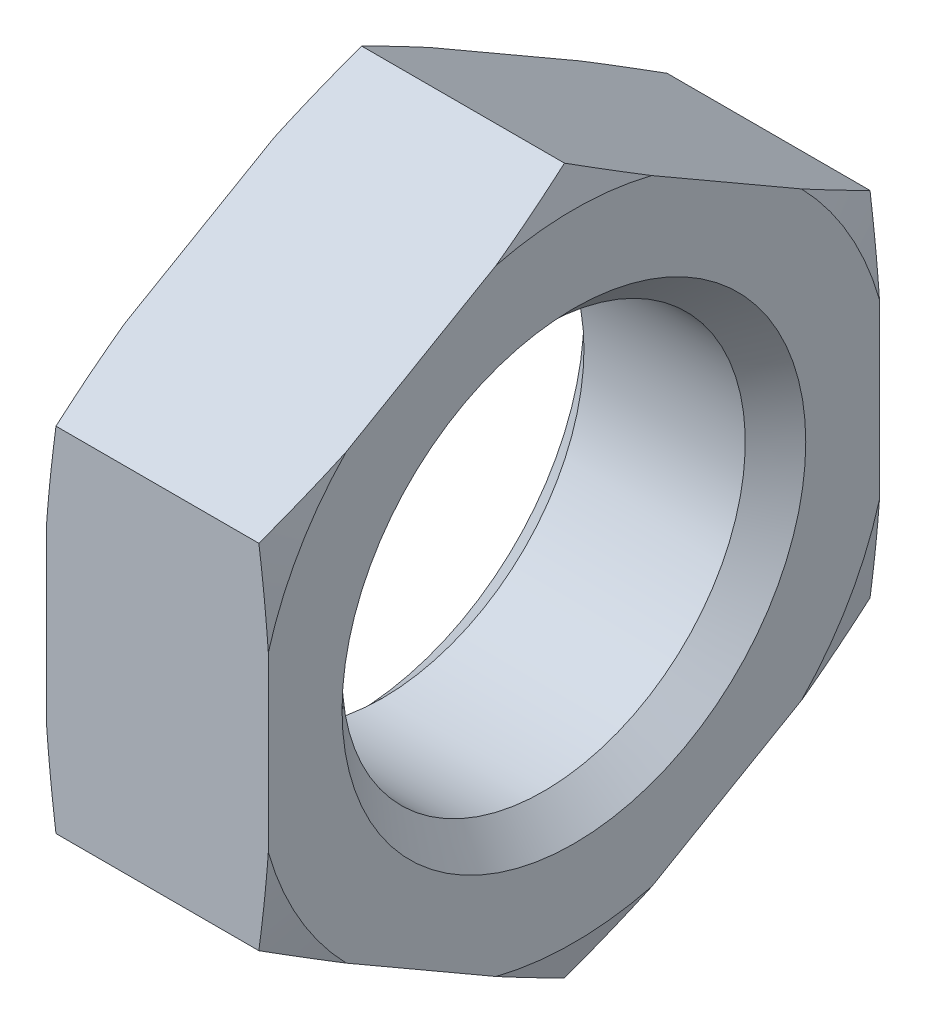
ISO-10303-21;
HEADER;
FILE_DESCRIPTION(('STEP AP214'),'2;1');
FILE_NAME('part.step','',(''),(''),'','','');
FILE_SCHEMA(('AUTOMOTIVE_DESIGN { 1 0 10303 214 1 1 1 1 }'));
ENDSEC;
DATA;
#1=APPLICATION_CONTEXT('core data for automotive mechanical design processes');
#2=APPLICATION_PROTOCOL_DEFINITION('international standard','automotive_design',2000,#1);
#3=PRODUCT_CONTEXT('',#1,'mechanical');
#4=PRODUCT('Part','Part','',(#3));
#5=PRODUCT_RELATED_PRODUCT_CATEGORY('part','',(#4));
#6=PRODUCT_DEFINITION_FORMATION('','',#4);
#7=PRODUCT_DEFINITION_CONTEXT('part definition',#1,'design');
#8=PRODUCT_DEFINITION('design','',#6,#7);
#9=PRODUCT_DEFINITION_SHAPE('','',#8);
#10=(LENGTH_UNIT() NAMED_UNIT(*) SI_UNIT(.MILLI.,.METRE.));
#11=(NAMED_UNIT(*) PLANE_ANGLE_UNIT() SI_UNIT($,.RADIAN.));
#12=(NAMED_UNIT(*) SI_UNIT($,.STERADIAN.) SOLID_ANGLE_UNIT());
#13=UNCERTAINTY_MEASURE_WITH_UNIT(LENGTH_MEASURE(1.E-05),#10,'distance_accuracy_value','');
#14=(GEOMETRIC_REPRESENTATION_CONTEXT(3) GLOBAL_UNCERTAINTY_ASSIGNED_CONTEXT((#13)) GLOBAL_UNIT_ASSIGNED_CONTEXT((#10,
#11,#12)) REPRESENTATION_CONTEXT('',''));
#15=CARTESIAN_POINT('',(0.,0.,0.));
#16=DIRECTION('',(0.,0.,1.));
#17=DIRECTION('',(1.,0.,0.));
#18=AXIS2_PLACEMENT_3D('',#15,#16,#17);
#19=CARTESIAN_POINT('',(1.1,2.,0.));
#20=DIRECTION('',(-1.,0.,0.));
#21=DIRECTION('',(0.,0.,1.));
#22=AXIS2_PLACEMENT_3D('',#19,#20,#21);
#23=PLANE('',#22);
#24=CARTESIAN_POINT('',(1.1,0.,0.));
#25=DIRECTION('',(-1.,0.,0.));
#26=DIRECTION('',(0.,0.,1.));
#27=AXIS2_PLACEMENT_3D('',#24,#25,#26);
#28=CIRCLE('',#27,2.3);
#29=CARTESIAN_POINT('',(1.1,0.,2.3));
#30=VERTEX_POINT('',#29);
#31=EDGE_CURVE('E495',#30,#30,#28,.T.);
#32=ORIENTED_EDGE('',*,*,#31,.T.);
#33=EDGE_LOOP('',(#32));
#34=FACE_BOUND('',#33,.T.);
#35=DIRECTION('',(0.,-0.500000000000001,0.866025403784438));
#36=VECTOR('',#35,1.);
#37=CARTESIAN_POINT('',(1.1,3.5,0.));
#38=LINE('',#37,#36);
#39=CARTESIAN_POINT('',(1.1,3.05366070498706,0.773082336376887));
#40=VERTEX_POINT('',#39);
#41=CARTESIAN_POINT('',(1.1,2.19633929501293,2.25800657686865));
#42=VERTEX_POINT('',#41);
#43=EDGE_CURVE('E218',#40,#42,#38,.T.);
#44=ORIENTED_EDGE('',*,*,#43,.T.);
#45=CARTESIAN_POINT('',(1.1,0.,0.));
#46=DIRECTION('',(-1.,0.,0.));
#47=DIRECTION('',(0.,0.,1.));
#48=AXIS2_PLACEMENT_3D('',#45,#46,#47);
#49=CIRCLE('',#48,3.15);
#50=CARTESIAN_POINT('',(1.1,0.857321409974109,3.03108891324554));
#51=VERTEX_POINT('',#50);
#52=EDGE_CURVE('E215',#51,#42,#49,.T.);
#53=ORIENTED_EDGE('',*,*,#52,.F.);
#54=DIRECTION('',(0.,-1.,0.));
#55=VECTOR('',#54,1.);
#56=CARTESIAN_POINT('',(1.1,1.74999999999999,3.03108891324554));
#57=LINE('',#56,#55);
#58=CARTESIAN_POINT('',(1.1,-0.857321409974132,3.03108891324553));
#59=VERTEX_POINT('',#58);
#60=EDGE_CURVE('E88',#51,#59,#57,.T.);
#61=ORIENTED_EDGE('',*,*,#60,.T.);
#62=CARTESIAN_POINT('',(1.1,-2.19633929501295,2.25800657686864));
#63=VERTEX_POINT('',#62);
#64=EDGE_CURVE('E213',#63,#59,#49,.T.);
#65=ORIENTED_EDGE('',*,*,#64,.F.);
#66=DIRECTION('',(0.,-0.499999999999995,-0.866025403784442));
#67=VECTOR('',#66,1.);
#68=CARTESIAN_POINT('',(1.1,-1.75000000000001,3.03108891324553));
#69=LINE('',#68,#67);
#70=CARTESIAN_POINT('',(1.1,-3.05366070498706,0.773082336376864));
#71=VERTEX_POINT('',#70);
#72=EDGE_CURVE('E217',#63,#71,#69,.T.);
#73=ORIENTED_EDGE('',*,*,#72,.T.);
#74=CARTESIAN_POINT('',(1.1,-3.05366070498705,-0.773082336376907));
#75=VERTEX_POINT('',#74);
#76=EDGE_CURVE('E223',#75,#71,#49,.T.);
#77=ORIENTED_EDGE('',*,*,#76,.F.);
#78=DIRECTION('',(0.,0.500000000000007,-0.866025403784435));
#79=VECTOR('',#78,1.);
#80=CARTESIAN_POINT('',(1.1,-3.5,0.));
#81=LINE('',#80,#79);
#82=CARTESIAN_POINT('',(1.1,-2.19633929501292,-2.25800657686867));
#83=VERTEX_POINT('',#82);
#84=EDGE_CURVE('E268',#75,#83,#81,.T.);
#85=ORIENTED_EDGE('',*,*,#84,.T.);
#86=CARTESIAN_POINT('',(1.1,-0.857321409974092,-3.03108891324554));
#87=VERTEX_POINT('',#86);
#88=EDGE_CURVE('E229',#87,#83,#49,.T.);
#89=ORIENTED_EDGE('',*,*,#88,.F.);
#90=DIRECTION('',(0.,1.,0.));
#91=VECTOR('',#90,1.);
#92=CARTESIAN_POINT('',(1.1,-1.74999999999997,-3.03108891324555));
#93=LINE('',#92,#91);
#94=CARTESIAN_POINT('',(1.1,0.857321409974154,-3.03108891324552));
#95=VERTEX_POINT('',#94);
#96=EDGE_CURVE('E266',#87,#95,#93,.T.);
#97=ORIENTED_EDGE('',*,*,#96,.T.);
#98=CARTESIAN_POINT('',(1.1,2.19633929501298,-2.25800657686861));
#99=VERTEX_POINT('',#98);
#100=EDGE_CURVE('E244',#99,#95,#49,.T.);
#101=ORIENTED_EDGE('',*,*,#100,.F.);
#102=DIRECTION('',(0.,0.499999999999995,0.866025403784441));
#103=VECTOR('',#102,1.);
#104=CARTESIAN_POINT('',(1.1,1.75000000000003,-3.03108891324551));
#105=LINE('',#104,#103);
#106=CARTESIAN_POINT('',(1.1,3.05366070498705,-0.773082336376908));
#107=VERTEX_POINT('',#106);
#108=EDGE_CURVE('E275',#99,#107,#105,.T.);
#109=ORIENTED_EDGE('',*,*,#108,.T.);
#110=EDGE_CURVE('E237',#40,#107,#49,.T.);
#111=ORIENTED_EDGE('',*,*,#110,.F.);
#112=EDGE_LOOP('',(#44,#53,#61,#65,#73,#77,#85,#89,#97,#101,#109,#111));
#113=FACE_BOUND('',#112,.T.);
#114=ADVANCED_FACE('F71',(#34,#113),#23,.F.);
#115=CARTESIAN_POINT('',(1.1,0.,0.));
#116=DIRECTION('',(-1.,0.,0.));
#117=DIRECTION('',(0.,0.,1.));
#118=AXIS2_PLACEMENT_3D('',#115,#116,#117);
#119=CONICAL_SURFACE('',#118,3.15,1.30899693899575);
#120=CARTESIAN_POINT('',(1.00610947351796,1.74959585481156,3.03178891324554));
#121=CARTESIAN_POINT('',(1.0256052308755,1.82230239029664,2.90585749974308));
#122=CARTESIAN_POINT('',(1.04330458977084,1.89514080805315,2.77969765944587));
#123=CARTESIAN_POINT('',(1.07440122173703,2.04107504352429,2.52693214904613));
#124=CARTESIAN_POINT('',(1.08779674493292,2.11417095375118,2.40032631870766));
#125=CARTESIAN_POINT('',(1.10950322208669,2.26017669628245,2.1474369544467));
#126=CARTESIAN_POINT('',(1.11784007850632,2.33308553991135,2.02115513296033));
#127=CARTESIAN_POINT('',(1.1290189999827,2.47899626954088,1.76843033587255));
#128=CARTESIAN_POINT('',(1.13186212966697,2.55199813477044,1.64198739624766));
#129=CARTESIAN_POINT('',(1.13186212966697,2.69800186522955,1.38910151699788));
#130=CARTESIAN_POINT('',(1.1290189999827,2.77100373045911,1.26265857737299));
#131=CARTESIAN_POINT('',(1.11784007850632,2.91691446008864,1.00993378028521));
#132=CARTESIAN_POINT('',(1.10950322208669,2.98982330371755,0.883651958798843));
#133=CARTESIAN_POINT('',(1.08779674493292,3.13582904624881,0.630762594537875));
#134=CARTESIAN_POINT('',(1.07440122173703,3.2089249564757,0.504156764199411));
#135=CARTESIAN_POINT('',(1.04330458977084,3.35485919194684,0.251391253799667));
#136=CARTESIAN_POINT('',(1.0256052308755,3.42769760970336,0.12523141350246));
#137=CARTESIAN_POINT('',(1.00610947351796,3.50040414518843,-0.000700000000000386));
#138=B_SPLINE_CURVE_WITH_KNOTS('',3,(#120,#121,#122,#123,#124,#125,#126,#127,#128,#129,#130,
#131,#132,#133,#134,#135,#136,#137),.UNSPECIFIED.,.F.,.F.,(4,2,2,2,2,2,2,2,4),(0.,
0.440165588767844,0.880509916439907,1.3185800421982,1.75656526597199,2.19455048974578,
2.63262061550407,3.07296494317613,3.51313053194398),.UNSPECIFIED.);
#139=CARTESIAN_POINT('',(1.00621778264911,3.5,0.));
#140=VERTEX_POINT('',#139);
#141=EDGE_CURVE('E346',#40,#140,#138,.T.);
#142=ORIENTED_EDGE('',*,*,#141,.F.);
#143=ORIENTED_EDGE('',*,*,#110,.T.);
#144=CARTESIAN_POINT('',(1.00610947351796,3.50040414518843,0.0007));
#145=CARTESIAN_POINT('',(1.0256052308755,3.42769760970336,-0.125231413502459));
#146=CARTESIAN_POINT('',(1.04330458977084,3.35485919194685,-0.251391253799665));
#147=CARTESIAN_POINT('',(1.07440122173703,3.20892495647571,-0.504156764199407));
#148=CARTESIAN_POINT('',(1.08779674493291,3.13582904624882,-0.63076259453787));
#149=CARTESIAN_POINT('',(1.10950322208669,2.98982330371756,-0.883651958798835));
#150=CARTESIAN_POINT('',(1.11784007850632,2.91691446008865,-1.0099337802852));
#151=CARTESIAN_POINT('',(1.1290189999827,2.77100373045913,-1.26265857737298));
#152=CARTESIAN_POINT('',(1.13186212966696,2.69800186522957,-1.38910151699787));
#153=CARTESIAN_POINT('',(1.13186212966696,2.55199813477046,-1.64198739624765));
#154=CARTESIAN_POINT('',(1.1290189999827,2.47899626954091,-1.76843033587253));
#155=CARTESIAN_POINT('',(1.11784007850632,2.33308553991138,-2.02115513296032));
#156=CARTESIAN_POINT('',(1.10950322208669,2.26017669628248,-2.14743695444668));
#157=CARTESIAN_POINT('',(1.08779674493291,2.11417095375122,-2.40032631870764));
#158=CARTESIAN_POINT('',(1.07440122173703,2.04107504352433,-2.52693214904611));
#159=CARTESIAN_POINT('',(1.04330458977084,1.89514080805319,-2.77969765944585));
#160=CARTESIAN_POINT('',(1.0256052308755,1.82230239029668,-2.90585749974305));
#161=CARTESIAN_POINT('',(1.00610947351796,1.7495958548116,-3.03178891324551));
#162=B_SPLINE_CURVE_WITH_KNOTS('',3,(#144,#145,#146,#147,#148,#149,#150,#151,#152,#153,#154,
#155,#156,#157,#158,#159,#160,#161),.UNSPECIFIED.,.F.,.F.,(4,2,2,2,2,2,2,2,4),(0.,
0.440165588767838,0.880509916439896,1.31858004219818,1.75656526597197,2.19455048974575,
2.63262061550404,3.07296494317609,3.51313053194393),.UNSPECIFIED.);
#163=EDGE_CURVE('E393',#140,#107,#162,.T.);
#164=ORIENTED_EDGE('',*,*,#163,.F.);
#165=EDGE_LOOP('',(#142,#143,#164));
#166=FACE_BOUND('',#165,.T.);
#167=ADVANCED_FACE('F354',(#166),#119,.T.);
#168=CARTESIAN_POINT('',(1.00621778264911,1.75000000000003,-3.03108891324551));
#169=VERTEX_POINT('',#168);
#170=EDGE_CURVE('E386',#99,#169,#162,.T.);
#171=ORIENTED_EDGE('',*,*,#170,.F.);
#172=ORIENTED_EDGE('',*,*,#100,.T.);
#173=CARTESIAN_POINT('',(1.00612398636583,1.75070000000004,-3.03108891324551));
#174=CARTESIAN_POINT('',(1.02561764201151,1.60529588468332,-3.03108891324552));
#175=CARTESIAN_POINT('',(1.04331502753195,1.45962803849627,-3.03108891324552));
#176=CARTESIAN_POINT('',(1.07440811334088,1.16777762856228,-3.03108891324552));
#177=CARTESIAN_POINT('',(1.08780206429238,1.02159487985723,-3.03108891324552));
#178=CARTESIAN_POINT('',(1.10950595979123,0.7296014747785,-3.03108891324552));
#179=CARTESIAN_POINT('',(1.11784180118863,0.583792795209892,-3.03108891324553));
#180=CARTESIAN_POINT('',(1.12901935399264,0.291989382743893,-3.03108891324553));
#181=CARTESIAN_POINT('',(1.13186212966697,0.145994691371962,-3.03108891324553));
#182=CARTESIAN_POINT('',(1.13186212966697,-0.145994691371899,-3.03108891324553));
#183=CARTESIAN_POINT('',(1.12901935399264,-0.29198938274383,-3.03108891324554));
#184=CARTESIAN_POINT('',(1.11784180118863,-0.583792795209829,-3.03108891324554));
#185=CARTESIAN_POINT('',(1.10950595979123,-0.729601474778437,-3.03108891324554));
#186=CARTESIAN_POINT('',(1.08780206429238,-1.02159487985716,-3.03108891324554));
#187=CARTESIAN_POINT('',(1.07440811334088,-1.16777762856222,-3.03108891324554));
#188=CARTESIAN_POINT('',(1.04331502753195,-1.45962803849621,-3.03108891324555));
#189=CARTESIAN_POINT('',(1.02561764201151,-1.60529588468325,-3.03108891324555));
#190=CARTESIAN_POINT('',(1.00612398636583,-1.75069999999997,-3.03108891324555));
#191=B_SPLINE_CURVE_WITH_KNOTS('',3,(#173,#174,#175,#176,#177,#178,#179,#180,#181,#182,#183,
#184,#185,#186,#187,#188,#189,#190),.UNSPECIFIED.,.F.,.F.,(4,2,2,2,2,2,2,2,4),(0.,
0.440138115142682,0.880454919794815,1.31849790923074,1.75645602042235,2.19441413161397,
2.63245712104989,3.07277392570203,3.51291204084471),.UNSPECIFIED.);
#192=EDGE_CURVE('E468',#169,#95,#191,.T.);
#193=ORIENTED_EDGE('',*,*,#192,.F.);
#194=EDGE_LOOP('',(#171,#172,#193));
#195=FACE_BOUND('',#194,.T.);
#196=ADVANCED_FACE('F358',(#195),#119,.T.);
#197=CARTESIAN_POINT('',(1.00621778264911,-1.74999999999997,-3.03108891324555));
#198=VERTEX_POINT('',#197);
#199=EDGE_CURVE('E263',#87,#198,#191,.T.);
#200=ORIENTED_EDGE('',*,*,#199,.F.);
#201=ORIENTED_EDGE('',*,*,#88,.T.);
#202=CARTESIAN_POINT('',(1.00610947351796,-1.74959585481154,-3.03178891324555));
#203=CARTESIAN_POINT('',(1.0256052308755,-1.82230239029662,-2.90585749974309));
#204=CARTESIAN_POINT('',(1.04330458977084,-1.89514080805313,-2.77969765944588));
#205=CARTESIAN_POINT('',(1.07440122173703,-2.04107504352428,-2.52693214904614));
#206=CARTESIAN_POINT('',(1.08779674493292,-2.11417095375117,-2.40032631870768));
#207=CARTESIAN_POINT('',(1.10950322208669,-2.26017669628243,-2.14743695444671));
#208=CARTESIAN_POINT('',(1.11784007850632,-2.33308553991134,-2.02115513296035));
#209=CARTESIAN_POINT('',(1.1290189999827,-2.47899626954087,-1.76843033587257));
#210=CARTESIAN_POINT('',(1.13186212966697,-2.55199813477043,-1.64198739624768));
#211=CARTESIAN_POINT('',(1.13186212966697,-2.69800186522954,-1.3891015169979));
#212=CARTESIAN_POINT('',(1.1290189999827,-2.7710037304591,-1.26265857737301));
#213=CARTESIAN_POINT('',(1.11784007850632,-2.91691446008863,-1.00993378028523));
#214=CARTESIAN_POINT('',(1.10950322208669,-2.98982330371754,-0.883651958798863));
#215=CARTESIAN_POINT('',(1.08779674493292,-3.13582904624881,-0.630762594537897));
#216=CARTESIAN_POINT('',(1.07440122173703,-3.20892495647569,-0.504156764199433));
#217=CARTESIAN_POINT('',(1.04330458977084,-3.35485919194684,-0.251391253799691));
#218=CARTESIAN_POINT('',(1.0256052308755,-3.42769760970336,-0.125231413502484));
#219=CARTESIAN_POINT('',(1.00610947351796,-3.50040414518843,0.000699999999975288));
#220=B_SPLINE_CURVE_WITH_KNOTS('',3,(#202,#203,#204,#205,#206,#207,#208,#209,#210,#211,#212,
#213,#214,#215,#216,#217,#218,#219),.UNSPECIFIED.,.F.,.F.,(4,2,2,2,2,2,2,2,4),(0.,
0.440165588767844,0.880509916439907,1.3185800421982,1.75656526597199,2.19455048974578,
2.63262061550407,3.07296494317613,3.51313053194397),.UNSPECIFIED.);
#221=EDGE_CURVE('E262',#198,#83,#220,.T.);
#222=ORIENTED_EDGE('',*,*,#221,.F.);
#223=EDGE_LOOP('',(#200,#201,#222));
#224=FACE_BOUND('',#223,.T.);
#225=ADVANCED_FACE('F261',(#224),#119,.T.);
#226=CARTESIAN_POINT('',(1.00621778264911,-3.5,0.));
#227=VERTEX_POINT('',#226);
#228=EDGE_CURVE('E373',#75,#227,#220,.T.);
#229=ORIENTED_EDGE('',*,*,#228,.F.);
#230=ORIENTED_EDGE('',*,*,#76,.T.);
#231=CARTESIAN_POINT('',(1.00610947351796,-3.50040414518843,-0.00070000000002444));
#232=CARTESIAN_POINT('',(1.0256052308755,-3.42769760970336,0.125231413502436));
#233=CARTESIAN_POINT('',(1.04330458977084,-3.35485919194685,0.251391253799644));
#234=CARTESIAN_POINT('',(1.07440122173703,-3.2089249564757,0.504156764199389));
#235=CARTESIAN_POINT('',(1.08779674493292,-3.13582904624881,0.630762594537853));
#236=CARTESIAN_POINT('',(1.10950322208669,-2.98982330371755,0.883651958798822));
#237=CARTESIAN_POINT('',(1.11784007850632,-2.91691446008864,1.00993378028519));
#238=CARTESIAN_POINT('',(1.1290189999827,-2.77100373045912,1.26265857737297));
#239=CARTESIAN_POINT('',(1.13186212966697,-2.69800186522956,1.38910151699786));
#240=CARTESIAN_POINT('',(1.13186212966697,-2.55199813477045,1.64198739624764));
#241=CARTESIAN_POINT('',(1.1290189999827,-2.47899626954089,1.76843033587253));
#242=CARTESIAN_POINT('',(1.11784007850632,-2.33308553991137,2.02115513296032));
#243=CARTESIAN_POINT('',(1.10950322208669,-2.26017669628246,2.14743695444668));
#244=CARTESIAN_POINT('',(1.08779674493292,-2.1141709537512,2.40032631870765));
#245=CARTESIAN_POINT('',(1.07440122173703,-2.04107504352431,2.52693214904611));
#246=CARTESIAN_POINT('',(1.04330458977084,-1.89514080805317,2.77969765944586));
#247=CARTESIAN_POINT('',(1.0256052308755,-1.82230239029666,2.90585749974307));
#248=CARTESIAN_POINT('',(1.00610947351796,-1.74959585481158,3.03178891324553));
#249=B_SPLINE_CURVE_WITH_KNOTS('',3,(#231,#232,#233,#234,#235,#236,#237,#238,#239,#240,#241,
#242,#243,#244,#245,#246,#247,#248),.UNSPECIFIED.,.F.,.F.,(4,2,2,2,2,2,2,2,4),(0.,
0.440165588767844,0.880509916439907,1.3185800421982,1.75656526597199,2.19455048974578,
2.63262061550407,3.07296494317613,3.51313053194398),.UNSPECIFIED.);
#250=EDGE_CURVE('E430',#227,#71,#249,.T.);
#251=ORIENTED_EDGE('',*,*,#250,.F.);
#252=EDGE_LOOP('',(#229,#230,#251));
#253=FACE_BOUND('',#252,.T.);
#254=ADVANCED_FACE('F532',(#253),#119,.T.);
#255=CARTESIAN_POINT('',(1.00621778264911,-1.75000000000001,3.03108891324553));
#256=VERTEX_POINT('',#255);
#257=EDGE_CURVE('E221',#63,#256,#249,.T.);
#258=ORIENTED_EDGE('',*,*,#257,.F.);
#259=ORIENTED_EDGE('',*,*,#64,.T.);
#260=CARTESIAN_POINT('',(1.00612398636583,-1.75070000000001,3.03108891324553));
#261=CARTESIAN_POINT('',(1.02561764201151,-1.60529588468329,3.03108891324553));
#262=CARTESIAN_POINT('',(1.04331502753195,-1.45962803849625,3.03108891324553));
#263=CARTESIAN_POINT('',(1.07440811334088,-1.16777762856226,3.03108891324553));
#264=CARTESIAN_POINT('',(1.08780206429238,-1.0215948798572,3.03108891324553));
#265=CARTESIAN_POINT('',(1.10950595979123,-0.729601474778479,3.03108891324553));
#266=CARTESIAN_POINT('',(1.11784180118863,-0.58379279520987,3.03108891324553));
#267=CARTESIAN_POINT('',(1.12901935399264,-0.291989382743872,3.03108891324553));
#268=CARTESIAN_POINT('',(1.13186212966697,-0.145994691371941,3.03108891324553));
#269=CARTESIAN_POINT('',(1.13186212966697,0.145994691371921,3.03108891324553));
#270=CARTESIAN_POINT('',(1.12901935399264,0.291989382743851,3.03108891324553));
#271=CARTESIAN_POINT('',(1.11784180118863,0.58379279520985,3.03108891324554));
#272=CARTESIAN_POINT('',(1.10950595979123,0.729601474778458,3.03108891324554));
#273=CARTESIAN_POINT('',(1.08780206429238,1.02159487985718,3.03108891324554));
#274=CARTESIAN_POINT('',(1.07440811334088,1.16777762856224,3.03108891324554));
#275=CARTESIAN_POINT('',(1.04331502753195,1.45962803849623,3.03108891324554));
#276=CARTESIAN_POINT('',(1.02561764201151,1.60529588468327,3.03108891324554));
#277=CARTESIAN_POINT('',(1.00612398636583,1.75069999999999,3.03108891324554));
#278=B_SPLINE_CURVE_WITH_KNOTS('',3,(#260,#261,#262,#263,#264,#265,#266,#267,#268,#269,#270,
#271,#272,#273,#274,#275,#276,#277),.UNSPECIFIED.,.F.,.F.,(4,2,2,2,2,2,2,2,4),(0.,
0.440138115142682,0.880454919794815,1.31849790923074,1.75645602042235,2.19441413161397,
2.63245712104989,3.07277392570203,3.51291204084471),.UNSPECIFIED.);
#279=EDGE_CURVE('E197',#256,#59,#278,.T.);
#280=ORIENTED_EDGE('',*,*,#279,.F.);
#281=EDGE_LOOP('',(#258,#259,#280));
#282=FACE_BOUND('',#281,.T.);
#283=ADVANCED_FACE('F220',(#282),#119,.T.);
#284=CARTESIAN_POINT('',(1.00621778264911,1.74999999999999,3.03108891324554));
#285=VERTEX_POINT('',#284);
#286=EDGE_CURVE('E352',#285,#42,#138,.T.);
#287=ORIENTED_EDGE('',*,*,#286,.F.);
#288=EDGE_CURVE('E206',#51,#285,#278,.T.);
#289=ORIENTED_EDGE('',*,*,#288,.F.);
#290=ORIENTED_EDGE('',*,*,#52,.T.);
#291=EDGE_LOOP('',(#287,#289,#290));
#292=FACE_BOUND('',#291,.T.);
#293=ADVANCED_FACE('F359',(#292),#119,.T.);
#294=CARTESIAN_POINT('',(-1.00621778264911,0.,0.));
#295=DIRECTION('',(1.,0.,0.));
#296=DIRECTION('',(0.,0.,-1.));
#297=AXIS2_PLACEMENT_3D('',#294,#295,#296);
#298=CONICAL_SURFACE('',#297,3.5,1.30899693899575);
#299=CARTESIAN_POINT('',(-1.00610947351796,3.50040414518843,-0.000700000000000015));
#300=CARTESIAN_POINT('',(-1.0256052308755,3.42769760970336,0.12523141350246));
#301=CARTESIAN_POINT('',(-1.04330458977084,3.35485919194684,0.251391253799667));
#302=CARTESIAN_POINT('',(-1.07440122173703,3.2089249564757,0.504156764199411));
#303=CARTESIAN_POINT('',(-1.08779674493292,3.13582904624881,0.630762594537875));
#304=CARTESIAN_POINT('',(-1.10950322208669,2.98982330371755,0.883651958798843));
#305=CARTESIAN_POINT('',(-1.11784007850632,2.91691446008864,1.00993378028521));
#306=CARTESIAN_POINT('',(-1.1290189999827,2.77100373045911,1.26265857737299));
#307=CARTESIAN_POINT('',(-1.13186212966697,2.69800186522955,1.38910151699788));
#308=CARTESIAN_POINT('',(-1.13186212966697,2.55199813477044,1.64198739624766));
#309=CARTESIAN_POINT('',(-1.1290189999827,2.47899626954088,1.76843033587255));
#310=CARTESIAN_POINT('',(-1.11784007850632,2.33308553991135,2.02115513296033));
#311=CARTESIAN_POINT('',(-1.10950322208669,2.26017669628245,2.1474369544467));
#312=CARTESIAN_POINT('',(-1.08779674493292,2.11417095375118,2.40032631870766));
#313=CARTESIAN_POINT('',(-1.07440122173703,2.04107504352429,2.52693214904613));
#314=CARTESIAN_POINT('',(-1.04330458977084,1.89514080805315,2.77969765944587));
#315=CARTESIAN_POINT('',(-1.0256052308755,1.82230239029664,2.90585749974308));
#316=CARTESIAN_POINT('',(-1.00610947351796,1.74959585481156,3.03178891324554));
#317=B_SPLINE_CURVE_WITH_KNOTS('',3,(#299,#300,#301,#302,#303,#304,#305,#306,#307,#308,#309,
#310,#311,#312,#313,#314,#315,#316),.UNSPECIFIED.,.F.,.F.,(4,2,2,2,2,2,2,2,4),(0.,
0.440165588767844,0.880509916439907,1.3185800421982,1.75656526597199,2.19455048974578,
2.63262061550407,3.07296494317613,3.51313053194398),.UNSPECIFIED.);
#318=CARTESIAN_POINT('',(-1.00621778264911,3.5,0.));
#319=VERTEX_POINT('',#318);
#320=CARTESIAN_POINT('',(-1.1,3.05366070498706,0.773082336376888));
#321=VERTEX_POINT('',#320);
#322=EDGE_CURVE('E353',#319,#321,#317,.T.);
#323=ORIENTED_EDGE('',*,*,#322,.F.);
#324=CARTESIAN_POINT('',(-1.00610947351796,1.7495958548116,-3.03178891324551));
#325=CARTESIAN_POINT('',(-1.0256052308755,1.82230239029668,-2.90585749974306));
#326=CARTESIAN_POINT('',(-1.04330458977084,1.89514080805319,-2.77969765944585));
#327=CARTESIAN_POINT('',(-1.07440122173703,2.04107504352433,-2.52693214904611));
#328=CARTESIAN_POINT('',(-1.08779674493291,2.11417095375122,-2.40032631870764));
#329=CARTESIAN_POINT('',(-1.10950322208669,2.26017669628248,-2.14743695444668));
#330=CARTESIAN_POINT('',(-1.11784007850632,2.33308553991138,-2.02115513296032));
#331=CARTESIAN_POINT('',(-1.1290189999827,2.47899626954091,-1.76843033587253));
#332=CARTESIAN_POINT('',(-1.13186212966696,2.55199813477046,-1.64198739624765));
#333=CARTESIAN_POINT('',(-1.13186212966696,2.69800186522957,-1.38910151699787));
#334=CARTESIAN_POINT('',(-1.1290189999827,2.77100373045913,-1.26265857737298));
#335=CARTESIAN_POINT('',(-1.11784007850632,2.91691446008865,-1.0099337802852));
#336=CARTESIAN_POINT('',(-1.10950322208669,2.98982330371756,-0.883651958798836));
#337=CARTESIAN_POINT('',(-1.08779674493291,3.13582904624882,-0.63076259453787));
#338=CARTESIAN_POINT('',(-1.07440122173703,3.20892495647571,-0.504156764199407));
#339=CARTESIAN_POINT('',(-1.04330458977084,3.35485919194685,-0.251391253799665));
#340=CARTESIAN_POINT('',(-1.0256052308755,3.42769760970336,-0.125231413502459));
#341=CARTESIAN_POINT('',(-1.00610947351796,3.50040414518843,0.000700000000000356));
#342=B_SPLINE_CURVE_WITH_KNOTS('',3,(#324,#325,#326,#327,#328,#329,#330,#331,#332,#333,#334,
#335,#336,#337,#338,#339,#340,#341),.UNSPECIFIED.,.F.,.F.,(4,2,2,2,2,2,2,2,4),(0.,
0.440165588767839,0.880509916439897,1.31858004219818,1.75656526597197,2.19455048974575,
2.63262061550404,3.07296494317609,3.51313053194393),.UNSPECIFIED.);
#343=CARTESIAN_POINT('',(-1.1,3.05366070498705,-0.773082336376912));
#344=VERTEX_POINT('',#343);
#345=EDGE_CURVE('E395',#344,#319,#342,.T.);
#346=ORIENTED_EDGE('',*,*,#345,.F.);
#347=CARTESIAN_POINT('',(-1.1,0.,0.));
#348=DIRECTION('',(-1.,0.,0.));
#349=DIRECTION('',(0.,0.,1.));
#350=AXIS2_PLACEMENT_3D('',#347,#348,#349);
#351=CIRCLE('',#350,3.15);
#352=EDGE_CURVE('E231',#321,#344,#351,.T.);
#353=ORIENTED_EDGE('',*,*,#352,.F.);
#354=EDGE_LOOP('',(#323,#346,#353));
#355=FACE_BOUND('',#354,.T.);
#356=ADVANCED_FACE('F318',(#355),#298,.T.);
#357=CARTESIAN_POINT('',(-1.00621778264911,1.75000000000003,-3.03108891324551));
#358=VERTEX_POINT('',#357);
#359=CARTESIAN_POINT('',(-1.1,2.19633929501298,-2.2580065768686));
#360=VERTEX_POINT('',#359);
#361=EDGE_CURVE('E394',#358,#360,#342,.T.);
#362=ORIENTED_EDGE('',*,*,#361,.F.);
#363=CARTESIAN_POINT('',(-1.00612398636583,-1.75069999999997,-3.03108891324555));
#364=CARTESIAN_POINT('',(-1.02561764201151,-1.60529588468325,-3.03108891324555));
#365=CARTESIAN_POINT('',(-1.04331502753195,-1.45962803849621,-3.03108891324555));
#366=CARTESIAN_POINT('',(-1.07440811334088,-1.16777762856222,-3.03108891324554));
#367=CARTESIAN_POINT('',(-1.08780206429238,-1.02159487985716,-3.03108891324554));
#368=CARTESIAN_POINT('',(-1.10950595979123,-0.729601474778437,-3.03108891324554));
#369=CARTESIAN_POINT('',(-1.11784180118863,-0.583792795209828,-3.03108891324554));
#370=CARTESIAN_POINT('',(-1.12901935399264,-0.29198938274383,-3.03108891324554));
#371=CARTESIAN_POINT('',(-1.13186212966697,-0.145994691371899,-3.03108891324553));
#372=CARTESIAN_POINT('',(-1.13186212966697,0.145994691371962,-3.03108891324553));
#373=CARTESIAN_POINT('',(-1.12901935399264,0.291989382743893,-3.03108891324553));
#374=CARTESIAN_POINT('',(-1.11784180118863,0.583792795209892,-3.03108891324553));
#375=CARTESIAN_POINT('',(-1.10950595979123,0.7296014747785,-3.03108891324552));
#376=CARTESIAN_POINT('',(-1.08780206429238,1.02159487985723,-3.03108891324552));
#377=CARTESIAN_POINT('',(-1.07440811334088,1.16777762856228,-3.03108891324552));
#378=CARTESIAN_POINT('',(-1.04331502753195,1.45962803849627,-3.03108891324552));
#379=CARTESIAN_POINT('',(-1.02561764201151,1.60529588468332,-3.03108891324552));
#380=CARTESIAN_POINT('',(-1.00612398636583,1.75070000000004,-3.03108891324551));
#381=B_SPLINE_CURVE_WITH_KNOTS('',3,(#363,#364,#365,#366,#367,#368,#369,#370,#371,#372,#373,
#374,#375,#376,#377,#378,#379,#380),.UNSPECIFIED.,.F.,.F.,(4,2,2,2,2,2,2,2,4),(0.,
0.440138115142682,0.880454919794815,1.31849790923074,1.75645602042235,2.19441413161397,
2.63245712104989,3.07277392570203,3.51291204084471),.UNSPECIFIED.);
#382=CARTESIAN_POINT('',(-1.1,0.857321409974151,-3.03108891324552));
#383=VERTEX_POINT('',#382);
#384=EDGE_CURVE('E411',#383,#358,#381,.T.);
#385=ORIENTED_EDGE('',*,*,#384,.F.);
#386=EDGE_CURVE('E462',#360,#383,#351,.T.);
#387=ORIENTED_EDGE('',*,*,#386,.F.);
#388=EDGE_LOOP('',(#362,#385,#387));
#389=FACE_BOUND('',#388,.T.);
#390=ADVANCED_FACE('F554',(#389),#298,.T.);
#391=CARTESIAN_POINT('',(-1.00621778264911,-1.74999999999997,-3.03108891324555));
#392=VERTEX_POINT('',#391);
#393=CARTESIAN_POINT('',(-1.1,-0.857321409974089,-3.03108891324554));
#394=VERTEX_POINT('',#393);
#395=EDGE_CURVE('E417',#392,#394,#381,.T.);
#396=ORIENTED_EDGE('',*,*,#395,.F.);
#397=CARTESIAN_POINT('',(-1.00610947351796,-3.50040414518843,0.000699999999975561));
#398=CARTESIAN_POINT('',(-1.0256052308755,-3.42769760970336,-0.125231413502484));
#399=CARTESIAN_POINT('',(-1.04330458977084,-3.35485919194684,-0.251391253799691));
#400=CARTESIAN_POINT('',(-1.07440122173703,-3.20892495647569,-0.504156764199434));
#401=CARTESIAN_POINT('',(-1.08779674493292,-3.13582904624881,-0.630762594537897));
#402=CARTESIAN_POINT('',(-1.10950322208669,-2.98982330371754,-0.883651958798863));
#403=CARTESIAN_POINT('',(-1.11784007850632,-2.91691446008863,-1.00993378028523));
#404=CARTESIAN_POINT('',(-1.1290189999827,-2.7710037304591,-1.26265857737301));
#405=CARTESIAN_POINT('',(-1.13186212966697,-2.69800186522954,-1.3891015169979));
#406=CARTESIAN_POINT('',(-1.13186212966697,-2.55199813477043,-1.64198739624768));
#407=CARTESIAN_POINT('',(-1.1290189999827,-2.47899626954087,-1.76843033587257));
#408=CARTESIAN_POINT('',(-1.11784007850632,-2.33308553991134,-2.02115513296035));
#409=CARTESIAN_POINT('',(-1.10950322208669,-2.26017669628243,-2.14743695444671));
#410=CARTESIAN_POINT('',(-1.08779674493292,-2.11417095375117,-2.40032631870768));
#411=CARTESIAN_POINT('',(-1.07440122173703,-2.04107504352428,-2.52693214904614));
#412=CARTESIAN_POINT('',(-1.04330458977084,-1.89514080805313,-2.77969765944588));
#413=CARTESIAN_POINT('',(-1.0256052308755,-1.82230239029662,-2.90585749974309));
#414=CARTESIAN_POINT('',(-1.00610947351796,-1.74959585481154,-3.03178891324555));
#415=B_SPLINE_CURVE_WITH_KNOTS('',3,(#397,#398,#399,#400,#401,#402,#403,#404,#405,#406,#407,
#408,#409,#410,#411,#412,#413,#414),.UNSPECIFIED.,.F.,.F.,(4,2,2,2,2,2,2,2,4),(0.,
0.440165588767844,0.880509916439907,1.3185800421982,1.75656526597199,2.19455048974578,
2.63262061550407,3.07296494317613,3.51313053194397),.UNSPECIFIED.);
#416=CARTESIAN_POINT('',(-1.1,-2.19633929501292,-2.25800657686867));
#417=VERTEX_POINT('',#416);
#418=EDGE_CURVE('E426',#417,#392,#415,.T.);
#419=ORIENTED_EDGE('',*,*,#418,.F.);
#420=EDGE_CURVE('E458',#394,#417,#351,.T.);
#421=ORIENTED_EDGE('',*,*,#420,.F.);
#422=EDGE_LOOP('',(#396,#419,#421));
#423=FACE_BOUND('',#422,.T.);
#424=ADVANCED_FACE('F476',(#423),#298,.T.);
#425=CARTESIAN_POINT('',(-1.00621778264911,-3.5,0.));
#426=VERTEX_POINT('',#425);
#427=CARTESIAN_POINT('',(-1.1,-3.05366070498705,-0.773082336376907));
#428=VERTEX_POINT('',#427);
#429=EDGE_CURVE('E423',#426,#428,#415,.T.);
#430=ORIENTED_EDGE('',*,*,#429,.F.);
#431=CARTESIAN_POINT('',(-1.00610947351796,-1.74959585481158,3.03178891324553));
#432=CARTESIAN_POINT('',(-1.0256052308755,-1.82230239029666,2.90585749974307));
#433=CARTESIAN_POINT('',(-1.04330458977084,-1.89514080805317,2.77969765944586));
#434=CARTESIAN_POINT('',(-1.07440122173703,-2.04107504352431,2.52693214904611));
#435=CARTESIAN_POINT('',(-1.08779674493292,-2.1141709537512,2.40032631870765));
#436=CARTESIAN_POINT('',(-1.10950322208669,-2.26017669628246,2.14743695444668));
#437=CARTESIAN_POINT('',(-1.11784007850632,-2.33308553991137,2.02115513296032));
#438=CARTESIAN_POINT('',(-1.1290189999827,-2.47899626954089,1.76843033587253));
#439=CARTESIAN_POINT('',(-1.13186212966697,-2.55199813477045,1.64198739624764));
#440=CARTESIAN_POINT('',(-1.13186212966697,-2.69800186522956,1.38910151699786));
#441=CARTESIAN_POINT('',(-1.1290189999827,-2.77100373045912,1.26265857737297));
#442=CARTESIAN_POINT('',(-1.11784007850632,-2.91691446008864,1.00993378028519));
#443=CARTESIAN_POINT('',(-1.10950322208669,-2.98982330371755,0.883651958798822));
#444=CARTESIAN_POINT('',(-1.08779674493292,-3.13582904624881,0.630762594537854));
#445=CARTESIAN_POINT('',(-1.07440122173703,-3.2089249564757,0.504156764199389));
#446=CARTESIAN_POINT('',(-1.04330458977084,-3.35485919194684,0.251391253799644));
#447=CARTESIAN_POINT('',(-1.0256052308755,-3.42769760970336,0.125231413502436));
#448=CARTESIAN_POINT('',(-1.00610947351796,-3.50040414518843,-0.000700000000024211));
#449=B_SPLINE_CURVE_WITH_KNOTS('',3,(#431,#432,#433,#434,#435,#436,#437,#438,#439,#440,#441,
#442,#443,#444,#445,#446,#447,#448),.UNSPECIFIED.,.F.,.F.,(4,2,2,2,2,2,2,2,4),(0.,
0.440165588767844,0.880509916439907,1.3185800421982,1.75656526597199,2.19455048974578,
2.63262061550407,3.07296494317613,3.51313053194398),.UNSPECIFIED.);
#450=CARTESIAN_POINT('',(-1.1,-3.05366070498706,0.773082336376867));
#451=VERTEX_POINT('',#450);
#452=EDGE_CURVE('E205',#451,#426,#449,.T.);
#453=ORIENTED_EDGE('',*,*,#452,.F.);
#454=EDGE_CURVE('E455',#428,#451,#351,.T.);
#455=ORIENTED_EDGE('',*,*,#454,.F.);
#456=EDGE_LOOP('',(#430,#453,#455));
#457=FACE_BOUND('',#456,.T.);
#458=ADVANCED_FACE('F454',(#457),#298,.T.);
#459=CARTESIAN_POINT('',(-1.1,2.19633929501294,2.25800657686865));
#460=VERTEX_POINT('',#459);
#461=CARTESIAN_POINT('',(-1.00621778264911,1.74999999999999,3.03108891324554));
#462=VERTEX_POINT('',#461);
#463=EDGE_CURVE('E339',#460,#462,#317,.T.);
#464=ORIENTED_EDGE('',*,*,#463,.F.);
#465=CARTESIAN_POINT('',(-1.1,0.857321409974109,3.03108891324554));
#466=VERTEX_POINT('',#465);
#467=EDGE_CURVE('E224',#466,#460,#351,.T.);
#468=ORIENTED_EDGE('',*,*,#467,.F.);
#469=CARTESIAN_POINT('',(-1.00612398636583,1.75069999999999,3.03108891324554));
#470=CARTESIAN_POINT('',(-1.02561764201151,1.60529588468327,3.03108891324554));
#471=CARTESIAN_POINT('',(-1.04331502753195,1.45962803849623,3.03108891324554));
#472=CARTESIAN_POINT('',(-1.07440811334088,1.16777762856224,3.03108891324554));
#473=CARTESIAN_POINT('',(-1.08780206429238,1.02159487985718,3.03108891324554));
#474=CARTESIAN_POINT('',(-1.10950595979123,0.729601474778458,3.03108891324554));
#475=CARTESIAN_POINT('',(-1.11784180118863,0.58379279520985,3.03108891324554));
#476=CARTESIAN_POINT('',(-1.12901935399264,0.291989382743851,3.03108891324553));
#477=CARTESIAN_POINT('',(-1.13186212966697,0.14599469137192,3.03108891324553));
#478=CARTESIAN_POINT('',(-1.13186212966697,-0.145994691371941,3.03108891324553));
#479=CARTESIAN_POINT('',(-1.12901935399264,-0.291989382743872,3.03108891324553));
#480=CARTESIAN_POINT('',(-1.11784180118863,-0.583792795209871,3.03108891324553));
#481=CARTESIAN_POINT('',(-1.10950595979123,-0.729601474778479,3.03108891324553));
#482=CARTESIAN_POINT('',(-1.08780206429238,-1.0215948798572,3.03108891324553));
#483=CARTESIAN_POINT('',(-1.07440811334088,-1.16777762856226,3.03108891324553));
#484=CARTESIAN_POINT('',(-1.04331502753195,-1.45962803849625,3.03108891324553));
#485=CARTESIAN_POINT('',(-1.02561764201151,-1.6052958846833,3.03108891324553));
#486=CARTESIAN_POINT('',(-1.00612398636583,-1.75070000000001,3.03108891324553));
#487=B_SPLINE_CURVE_WITH_KNOTS('',3,(#469,#470,#471,#472,#473,#474,#475,#476,#477,#478,#479,
#480,#481,#482,#483,#484,#485,#486),.UNSPECIFIED.,.F.,.F.,(4,2,2,2,2,2,2,2,4),(0.,
0.440138115142682,0.880454919794815,1.31849790923074,1.75645602042235,2.19441413161397,
2.63245712104989,3.07277392570203,3.51291204084471),.UNSPECIFIED.);
#488=EDGE_CURVE('E95',#462,#466,#487,.T.);
#489=ORIENTED_EDGE('',*,*,#488,.F.);
#490=EDGE_LOOP('',(#464,#468,#489));
#491=FACE_BOUND('',#490,.T.);
#492=ADVANCED_FACE('F573',(#491),#298,.T.);
#493=CARTESIAN_POINT('',(-1.00621778264911,-1.75000000000001,3.03108891324553));
#494=VERTEX_POINT('',#493);
#495=CARTESIAN_POINT('',(-1.1,-2.19633929501295,2.25800657686863));
#496=VERTEX_POINT('',#495);
#497=EDGE_CURVE('E441',#494,#496,#449,.T.);
#498=ORIENTED_EDGE('',*,*,#497,.F.);
#499=CARTESIAN_POINT('',(-1.1,-0.857321409974129,3.03108891324553));
#500=VERTEX_POINT('',#499);
#501=EDGE_CURVE('E287',#500,#494,#487,.T.);
#502=ORIENTED_EDGE('',*,*,#501,.F.);
#503=EDGE_CURVE('E233',#496,#500,#351,.T.);
#504=ORIENTED_EDGE('',*,*,#503,.F.);
#505=EDGE_LOOP('',(#498,#502,#504));
#506=FACE_BOUND('',#505,.T.);
#507=ADVANCED_FACE('F556',(#506),#298,.T.);
#508=CARTESIAN_POINT('',(-1.1,3.15,0.));
#509=DIRECTION('',(1.,0.,0.));
#510=DIRECTION('',(0.,0.,-1.));
#511=AXIS2_PLACEMENT_3D('',#508,#509,#510);
#512=PLANE('',#511);
#513=CARTESIAN_POINT('',(-1.1,0.,0.));
#514=DIRECTION('',(1.,0.,0.));
#515=DIRECTION('',(0.,0.,-1.));
#516=AXIS2_PLACEMENT_3D('',#513,#514,#515);
#517=CIRCLE('',#516,2.3);
#518=CARTESIAN_POINT('',(-1.1,0.,-2.3));
#519=VERTEX_POINT('',#518);
#520=EDGE_CURVE('E13',#519,#519,#517,.T.);
#521=ORIENTED_EDGE('',*,*,#520,.T.);
#522=EDGE_LOOP('',(#521));
#523=FACE_BOUND('',#522,.T.);
#524=DIRECTION('',(0.,-0.500000000000001,0.866025403784438));
#525=VECTOR('',#524,1.);
#526=CARTESIAN_POINT('',(-1.1,3.4125,0.151554445662277));
#527=LINE('',#526,#525);
#528=EDGE_CURVE('E488',#321,#460,#527,.T.);
#529=ORIENTED_EDGE('',*,*,#528,.F.);
#530=ORIENTED_EDGE('',*,*,#352,.T.);
#531=DIRECTION('',(0.,0.499999999999995,0.866025403784441));
#532=VECTOR('',#531,1.);
#533=CARTESIAN_POINT('',(-1.1,3.4125,-0.151554445662276));
#534=LINE('',#533,#532);
#535=EDGE_CURVE('E484',#360,#344,#534,.T.);
#536=ORIENTED_EDGE('',*,*,#535,.F.);
#537=ORIENTED_EDGE('',*,*,#386,.T.);
#538=DIRECTION('',(0.,1.,0.));
#539=VECTOR('',#538,1.);
#540=CARTESIAN_POINT('',(-1.1,3.15000000000003,-3.0310889132455));
#541=LINE('',#540,#539);
#542=EDGE_CURVE('E480',#394,#383,#541,.T.);
#543=ORIENTED_EDGE('',*,*,#542,.F.);
#544=ORIENTED_EDGE('',*,*,#420,.T.);
#545=DIRECTION('',(0.,0.500000000000007,-0.866025403784435));
#546=VECTOR('',#545,1.);
#547=CARTESIAN_POINT('',(-1.1,-1.83749999999996,-2.87953446758329));
#548=LINE('',#547,#546);
#549=EDGE_CURVE('E478',#428,#417,#548,.T.);
#550=ORIENTED_EDGE('',*,*,#549,.F.);
#551=ORIENTED_EDGE('',*,*,#454,.T.);
#552=DIRECTION('',(0.,-0.499999999999995,-0.866025403784442));
#553=VECTOR('',#552,1.);
#554=CARTESIAN_POINT('',(-1.1,-1.83750000000002,2.87953446758323));
#555=LINE('',#554,#553);
#556=EDGE_CURVE('E242',#496,#451,#555,.T.);
#557=ORIENTED_EDGE('',*,*,#556,.F.);
#558=ORIENTED_EDGE('',*,*,#503,.T.);
#559=DIRECTION('',(0.,-1.,0.));
#560=VECTOR('',#559,1.);
#561=CARTESIAN_POINT('',(-1.1,3.14999999999999,3.03108891324554));
#562=LINE('',#561,#560);
#563=EDGE_CURVE('E236',#466,#500,#562,.T.);
#564=ORIENTED_EDGE('',*,*,#563,.F.);
#565=ORIENTED_EDGE('',*,*,#467,.T.);
#566=EDGE_LOOP('',(#529,#530,#536,#537,#543,#544,#550,#551,#557,#558,#564,#565));
#567=FACE_BOUND('',#566,.T.);
#568=ADVANCED_FACE('F336',(#523,#567),#512,.F.);
#569=CARTESIAN_POINT('',(-2.78527837974684,0.,0.));
#570=DIRECTION('',(-1.,0.,0.));
#571=DIRECTION('',(0.,0.,1.));
#572=AXIS2_PLACEMENT_3D('',#569,#570,#571);
#573=CYLINDRICAL_SURFACE('',#572,2.);
#574=CARTESIAN_POINT('',(0.8,0.,0.));
#575=DIRECTION('',(-1.,0.,0.));
#576=DIRECTION('',(0.,0.,1.));
#577=AXIS2_PLACEMENT_3D('',#574,#575,#576);
#578=CIRCLE('',#577,2.);
#579=CARTESIAN_POINT('',(0.8,0.,2.));
#580=VERTEX_POINT('',#579);
#581=EDGE_CURVE('E81',#580,#580,#578,.F.);
#582=ORIENTED_EDGE('',*,*,#581,.T.);
#583=EDGE_LOOP('',(#582));
#584=FACE_BOUND('',#583,.T.);
#585=CARTESIAN_POINT('',(-0.799999999999999,0.,0.));
#586=DIRECTION('',(1.,0.,0.));
#587=DIRECTION('',(0.,0.,-1.));
#588=AXIS2_PLACEMENT_3D('',#585,#586,#587);
#589=CIRCLE('',#588,2.);
#590=CARTESIAN_POINT('',(-0.799999999999999,0.,-2.));
#591=VERTEX_POINT('',#590);
#592=EDGE_CURVE('E499',#591,#591,#589,.F.);
#593=ORIENTED_EDGE('',*,*,#592,.T.);
#594=EDGE_LOOP('',(#593));
#595=FACE_BOUND('',#594,.T.);
#596=ADVANCED_FACE('F334',(#584,#595),#573,.F.);
#597=CARTESIAN_POINT('',(-1.1,3.5,0.));
#598=DIRECTION('',(0.,0.866025403784438,0.500000000000001));
#599=DIRECTION('',(0.,-0.500000000000001,0.866025403784438));
#600=AXIS2_PLACEMENT_3D('',#597,#598,#599);
#601=PLANE('',#600);
#602=ORIENTED_EDGE('',*,*,#286,.T.);
#603=ORIENTED_EDGE('',*,*,#43,.F.);
#604=ORIENTED_EDGE('',*,*,#141,.T.);
#605=DIRECTION('',(1.,0.,0.));
#606=VECTOR('',#605,1.);
#607=CARTESIAN_POINT('',(-1.1,3.5,0.));
#608=LINE('',#607,#606);
#609=EDGE_CURVE('E283',#319,#140,#608,.T.);
#610=ORIENTED_EDGE('',*,*,#609,.F.);
#611=ORIENTED_EDGE('',*,*,#322,.T.);
#612=ORIENTED_EDGE('',*,*,#528,.T.);
#613=ORIENTED_EDGE('',*,*,#463,.T.);
#614=DIRECTION('',(1.,0.,0.));
#615=VECTOR('',#614,1.);
#616=CARTESIAN_POINT('',(-1.1,1.74999999999999,3.03108891324554));
#617=LINE('',#616,#615);
#618=EDGE_CURVE('E282',#462,#285,#617,.T.);
#619=ORIENTED_EDGE('',*,*,#618,.T.);
#620=EDGE_LOOP('',(#602,#603,#604,#610,#611,#612,#613,#619));
#621=FACE_BOUND('',#620,.T.);
#622=ADVANCED_FACE('F329',(#621),#601,.T.);
#623=CARTESIAN_POINT('',(-1.1,1.75000000000003,-3.03108891324551));
#624=DIRECTION('',(0.,0.866025403784441,-0.499999999999995));
#625=DIRECTION('',(0.,0.499999999999995,0.866025403784441));
#626=AXIS2_PLACEMENT_3D('',#623,#624,#625);
#627=PLANE('',#626);
#628=ORIENTED_EDGE('',*,*,#163,.T.);
#629=ORIENTED_EDGE('',*,*,#108,.F.);
#630=ORIENTED_EDGE('',*,*,#170,.T.);
#631=DIRECTION('',(1.,0.,0.));
#632=VECTOR('',#631,1.);
#633=CARTESIAN_POINT('',(-1.1,1.75000000000003,-3.03108891324551));
#634=LINE('',#633,#632);
#635=EDGE_CURVE('E288',#358,#169,#634,.T.);
#636=ORIENTED_EDGE('',*,*,#635,.F.);
#637=ORIENTED_EDGE('',*,*,#361,.T.);
#638=ORIENTED_EDGE('',*,*,#535,.T.);
#639=ORIENTED_EDGE('',*,*,#345,.T.);
#640=ORIENTED_EDGE('',*,*,#609,.T.);
#641=EDGE_LOOP('',(#628,#629,#630,#636,#637,#638,#639,#640));
#642=FACE_BOUND('',#641,.T.);
#643=ADVANCED_FACE('F333',(#642),#627,.T.);
#644=CARTESIAN_POINT('',(-1.1,-1.74999999999997,-3.03108891324555));
#645=DIRECTION('',(0.,0.,-1.));
#646=DIRECTION('',(0.,1.,0.));
#647=AXIS2_PLACEMENT_3D('',#644,#645,#646);
#648=PLANE('',#647);
#649=ORIENTED_EDGE('',*,*,#192,.T.);
#650=ORIENTED_EDGE('',*,*,#96,.F.);
#651=ORIENTED_EDGE('',*,*,#199,.T.);
#652=DIRECTION('',(1.,0.,0.));
#653=VECTOR('',#652,1.);
#654=CARTESIAN_POINT('',(-1.1,-1.74999999999997,-3.03108891324555));
#655=LINE('',#654,#653);
#656=EDGE_CURVE('E292',#392,#198,#655,.T.);
#657=ORIENTED_EDGE('',*,*,#656,.F.);
#658=ORIENTED_EDGE('',*,*,#395,.T.);
#659=ORIENTED_EDGE('',*,*,#542,.T.);
#660=ORIENTED_EDGE('',*,*,#384,.T.);
#661=ORIENTED_EDGE('',*,*,#635,.T.);
#662=EDGE_LOOP('',(#649,#650,#651,#657,#658,#659,#660,#661));
#663=FACE_BOUND('',#662,.T.);
#664=ADVANCED_FACE('F402',(#663),#648,.T.);
#665=CARTESIAN_POINT('',(-1.1,-3.5,0.));
#666=DIRECTION('',(0.,-0.866025403784435,-0.500000000000007));
#667=DIRECTION('',(0.,0.500000000000007,-0.866025403784435));
#668=AXIS2_PLACEMENT_3D('',#665,#666,#667);
#669=PLANE('',#668);
#670=ORIENTED_EDGE('',*,*,#221,.T.);
#671=ORIENTED_EDGE('',*,*,#84,.F.);
#672=ORIENTED_EDGE('',*,*,#228,.T.);
#673=DIRECTION('',(1.,0.,0.));
#674=VECTOR('',#673,1.);
#675=CARTESIAN_POINT('',(-1.1,-3.5,0.));
#676=LINE('',#675,#674);
#677=EDGE_CURVE('E296',#426,#227,#676,.T.);
#678=ORIENTED_EDGE('',*,*,#677,.F.);
#679=ORIENTED_EDGE('',*,*,#429,.T.);
#680=ORIENTED_EDGE('',*,*,#549,.T.);
#681=ORIENTED_EDGE('',*,*,#418,.T.);
#682=ORIENTED_EDGE('',*,*,#656,.T.);
#683=EDGE_LOOP('',(#670,#671,#672,#678,#679,#680,#681,#682));
#684=FACE_BOUND('',#683,.T.);
#685=ADVANCED_FACE('F407',(#684),#669,.T.);
#686=CARTESIAN_POINT('',(-1.1,-1.75000000000001,3.03108891324553));
#687=DIRECTION('',(0.,-0.866025403784442,0.499999999999995));
#688=DIRECTION('',(0.,-0.499999999999995,-0.866025403784442));
#689=AXIS2_PLACEMENT_3D('',#686,#687,#688);
#690=PLANE('',#689);
#691=ORIENTED_EDGE('',*,*,#250,.T.);
#692=ORIENTED_EDGE('',*,*,#72,.F.);
#693=ORIENTED_EDGE('',*,*,#257,.T.);
#694=DIRECTION('',(1.,0.,0.));
#695=VECTOR('',#694,1.);
#696=CARTESIAN_POINT('',(-1.1,-1.75000000000001,3.03108891324553));
#697=LINE('',#696,#695);
#698=EDGE_CURVE('E200',#494,#256,#697,.T.);
#699=ORIENTED_EDGE('',*,*,#698,.F.);
#700=ORIENTED_EDGE('',*,*,#497,.T.);
#701=ORIENTED_EDGE('',*,*,#556,.T.);
#702=ORIENTED_EDGE('',*,*,#452,.T.);
#703=ORIENTED_EDGE('',*,*,#677,.T.);
#704=EDGE_LOOP('',(#691,#692,#693,#699,#700,#701,#702,#703));
#705=FACE_BOUND('',#704,.T.);
#706=ADVANCED_FACE('F326',(#705),#690,.T.);
#707=CARTESIAN_POINT('',(-1.1,1.74999999999999,3.03108891324554));
#708=DIRECTION('',(0.,0.,1.));
#709=DIRECTION('',(0.,-1.,0.));
#710=AXIS2_PLACEMENT_3D('',#707,#708,#709);
#711=PLANE('',#710);
#712=ORIENTED_EDGE('',*,*,#279,.T.);
#713=ORIENTED_EDGE('',*,*,#60,.F.);
#714=ORIENTED_EDGE('',*,*,#288,.T.);
#715=ORIENTED_EDGE('',*,*,#618,.F.);
#716=ORIENTED_EDGE('',*,*,#488,.T.);
#717=ORIENTED_EDGE('',*,*,#563,.T.);
#718=ORIENTED_EDGE('',*,*,#501,.T.);
#719=ORIENTED_EDGE('',*,*,#698,.T.);
#720=EDGE_LOOP('',(#712,#713,#714,#715,#716,#717,#718,#719));
#721=FACE_BOUND('',#720,.T.);
#722=ADVANCED_FACE('F198',(#721),#711,.T.);
#723=CARTESIAN_POINT('',(1.1,0.,0.));
#724=DIRECTION('',(1.,0.,0.));
#725=DIRECTION('',(0.,0.,-1.));
#726=AXIS2_PLACEMENT_3D('',#723,#724,#725);
#727=CONICAL_SURFACE('',#726,2.3,0.785398163397448);
#728=ORIENTED_EDGE('',*,*,#581,.F.);
#729=EDGE_LOOP('',(#728));
#730=FACE_BOUND('',#729,.T.);
#731=ORIENTED_EDGE('',*,*,#31,.F.);
#732=EDGE_LOOP('',(#731));
#733=FACE_BOUND('',#732,.T.);
#734=ADVANCED_FACE('F325',(#730,#733),#727,.F.);
#735=CARTESIAN_POINT('',(-0.799999999999999,0.,0.));
#736=DIRECTION('',(-1.,0.,0.));
#737=DIRECTION('',(0.,0.,1.));
#738=AXIS2_PLACEMENT_3D('',#735,#736,#737);
#739=CONICAL_SURFACE('',#738,2.,0.785398163397451);
#740=ORIENTED_EDGE('',*,*,#520,.F.);
#741=EDGE_LOOP('',(#740));
#742=FACE_BOUND('',#741,.T.);
#743=ORIENTED_EDGE('',*,*,#592,.F.);
#744=EDGE_LOOP('',(#743));
#745=FACE_BOUND('',#744,.T.);
#746=ADVANCED_FACE('F74',(#742,#745),#739,.F.);
#747=CLOSED_SHELL('',(#114,#167,#196,#225,#254,#283,#293,#356,#390,#424,#458,#492,#507,#568,
#596,#622,#643,#664,#685,#706,#722,#734,#746));
#748=MANIFOLD_SOLID_BREP('B2',#747);
#749=ADVANCED_BREP_SHAPE_REPRESENTATION('',(#18,#748),#14);
#750=SHAPE_DEFINITION_REPRESENTATION(#9,#749);
ENDSEC;
END-ISO-10303-21;
